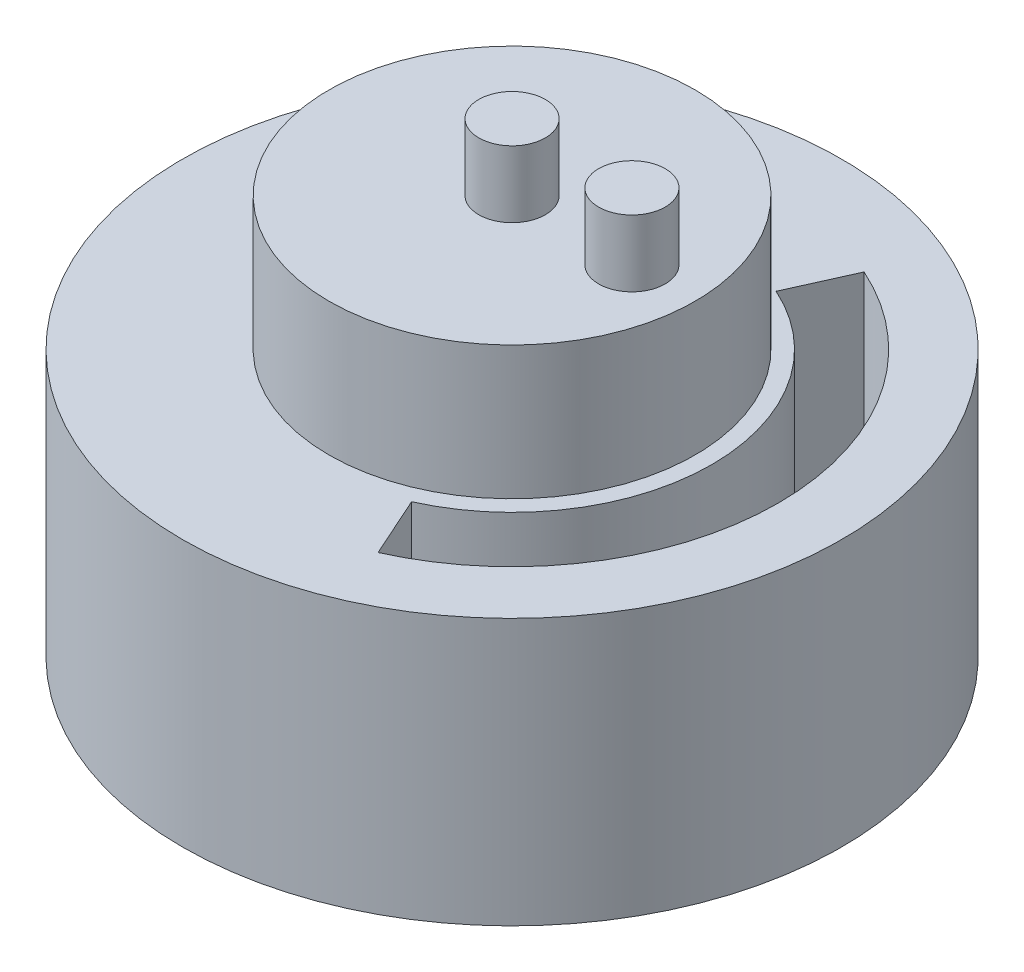
ISO-10303-21;
HEADER;
FILE_DESCRIPTION(('STEP AP214'),'2;1');
FILE_NAME('part.step','',(''),(''),'','','');
FILE_SCHEMA(('AUTOMOTIVE_DESIGN { 1 0 10303 214 1 1 1 1 }'));
ENDSEC;
DATA;
#1=APPLICATION_CONTEXT('core data for automotive mechanical design processes');
#2=APPLICATION_PROTOCOL_DEFINITION('international standard','automotive_design',2000,#1);
#3=PRODUCT_CONTEXT('',#1,'mechanical');
#4=PRODUCT('Part','Part','',(#3));
#5=PRODUCT_RELATED_PRODUCT_CATEGORY('part','',(#4));
#6=PRODUCT_DEFINITION_FORMATION('','',#4);
#7=PRODUCT_DEFINITION_CONTEXT('part definition',#1,'design');
#8=PRODUCT_DEFINITION('design','',#6,#7);
#9=PRODUCT_DEFINITION_SHAPE('','',#8);
#10=(LENGTH_UNIT() NAMED_UNIT(*) SI_UNIT(.MILLI.,.METRE.));
#11=(NAMED_UNIT(*) PLANE_ANGLE_UNIT() SI_UNIT($,.RADIAN.));
#12=(NAMED_UNIT(*) SI_UNIT($,.STERADIAN.) SOLID_ANGLE_UNIT());
#13=UNCERTAINTY_MEASURE_WITH_UNIT(LENGTH_MEASURE(1.E-05),#10,'distance_accuracy_value','');
#14=(GEOMETRIC_REPRESENTATION_CONTEXT(3) GLOBAL_UNCERTAINTY_ASSIGNED_CONTEXT((#13)) GLOBAL_UNIT_ASSIGNED_CONTEXT((#10,
#11,#12)) REPRESENTATION_CONTEXT('',''));
#15=CARTESIAN_POINT('',(0.,0.,0.));
#16=DIRECTION('',(0.,0.,1.));
#17=DIRECTION('',(1.,0.,0.));
#18=AXIS2_PLACEMENT_3D('',#15,#16,#17);
#19=CARTESIAN_POINT('',(0.,20.,0.));
#20=DIRECTION('',(0.,-1.,0.));
#21=DIRECTION('',(0.,0.,-1.));
#22=AXIS2_PLACEMENT_3D('',#19,#20,#21);
#23=CYLINDRICAL_SURFACE('',#22,24.75);
#24=CARTESIAN_POINT('',(0.,20.,0.));
#25=DIRECTION('',(0.,1.,0.));
#26=DIRECTION('',(0.,0.,1.));
#27=AXIS2_PLACEMENT_3D('',#24,#25,#26);
#28=CIRCLE('',#27,24.75);
#29=CARTESIAN_POINT('',(0.,20.,24.75));
#30=VERTEX_POINT('',#29);
#31=EDGE_CURVE('E141',#30,#30,#28,.T.);
#32=ORIENTED_EDGE('',*,*,#31,.F.);
#33=EDGE_LOOP('',(#32));
#34=FACE_BOUND('',#33,.T.);
#35=CARTESIAN_POINT('',(0.,0.,0.));
#36=DIRECTION('',(0.,1.,0.));
#37=DIRECTION('',(0.,0.,1.));
#38=AXIS2_PLACEMENT_3D('',#35,#36,#37);
#39=CIRCLE('',#38,24.75);
#40=CARTESIAN_POINT('',(0.,0.,24.75));
#41=VERTEX_POINT('',#40);
#42=EDGE_CURVE('E44',#41,#41,#39,.T.);
#43=ORIENTED_EDGE('',*,*,#42,.T.);
#44=EDGE_LOOP('',(#43));
#45=FACE_BOUND('',#44,.T.);
#46=ADVANCED_FACE('F41',(#34,#45),#23,.T.);
#47=CARTESIAN_POINT('',(0.,20.,0.));
#48=DIRECTION('',(0.,1.,0.));
#49=DIRECTION('',(0.,0.,1.));
#50=AXIS2_PLACEMENT_3D('',#47,#48,#49);
#51=PLANE('',#50);
#52=CARTESIAN_POINT('',(0.,20.,0.));
#53=DIRECTION('',(0.,-1.,0.));
#54=DIRECTION('',(0.,0.,1.));
#55=AXIS2_PLACEMENT_3D('',#52,#53,#54);
#56=CIRCLE('',#55,15.);
#57=CARTESIAN_POINT('',(6.13929231044262,20.,-13.6860911120356));
#58=VERTEX_POINT('',#57);
#59=CARTESIAN_POINT('',(6.13929231044262,20.,13.6860911120356));
#60=VERTEX_POINT('',#59);
#61=EDGE_CURVE('E58',#58,#60,#56,.T.);
#62=ORIENTED_EDGE('',*,*,#61,.F.);
#63=DIRECTION('',(-0.409286154029508,0.,0.912406074135707));
#64=VECTOR('',#63,1.);
#65=CARTESIAN_POINT('',(8.18572308059016,20.,-18.2481214827141));
#66=LINE('',#65,#64);
#67=CARTESIAN_POINT('',(8.18572308059016,20.,-18.2481214827141));
#68=VERTEX_POINT('',#67);
#69=EDGE_CURVE('E105',#68,#58,#66,.T.);
#70=ORIENTED_EDGE('',*,*,#69,.F.);
#71=CARTESIAN_POINT('',(0.,20.,0.));
#72=DIRECTION('',(0.,1.,0.));
#73=DIRECTION('',(0.,0.,1.));
#74=AXIS2_PLACEMENT_3D('',#71,#72,#73);
#75=CIRCLE('',#74,20.);
#76=CARTESIAN_POINT('',(8.18572308059016,20.,18.2481214827141));
#77=VERTEX_POINT('',#76);
#78=EDGE_CURVE('E87',#77,#68,#75,.T.);
#79=ORIENTED_EDGE('',*,*,#78,.F.);
#80=DIRECTION('',(0.409286154029508,0.,0.912406074135707));
#81=VECTOR('',#80,1.);
#82=CARTESIAN_POINT('',(8.18572308059016,20.,18.2481214827141));
#83=LINE('',#82,#81);
#84=EDGE_CURVE('E97',#60,#77,#83,.T.);
#85=ORIENTED_EDGE('',*,*,#84,.F.);
#86=EDGE_LOOP('',(#62,#70,#79,#85));
#87=FACE_BOUND('',#86,.T.);
#88=CARTESIAN_POINT('',(0.,20.,0.));
#89=DIRECTION('',(0.,1.,0.));
#90=DIRECTION('',(0.,0.,1.));
#91=AXIS2_PLACEMENT_3D('',#88,#89,#90);
#92=CIRCLE('',#91,13.75);
#93=CARTESIAN_POINT('',(0.,20.,13.75));
#94=VERTEX_POINT('',#93);
#95=EDGE_CURVE('E50',#94,#94,#92,.T.);
#96=ORIENTED_EDGE('',*,*,#95,.F.);
#97=EDGE_LOOP('',(#96));
#98=FACE_BOUND('',#97,.T.);
#99=ORIENTED_EDGE('',*,*,#31,.T.);
#100=EDGE_LOOP('',(#99));
#101=FACE_BOUND('',#100,.T.);
#102=ADVANCED_FACE('F102',(#87,#98,#101),#51,.T.);
#103=CARTESIAN_POINT('',(0.,0.,0.));
#104=DIRECTION('',(0.,1.,0.));
#105=DIRECTION('',(0.,0.,1.));
#106=AXIS2_PLACEMENT_3D('',#103,#104,#105);
#107=PLANE('',#106);
#108=DIRECTION('',(0.409286154029508,0.,-0.912406074135707));
#109=VECTOR('',#108,1.);
#110=CARTESIAN_POINT('',(8.18572308059016,0.,-18.2481214827141));
#111=LINE('',#110,#109);
#112=CARTESIAN_POINT('',(6.13929231044262,0.,-13.6860911120356));
#113=VERTEX_POINT('',#112);
#114=CARTESIAN_POINT('',(8.18572308059016,0.,-18.2481214827141));
#115=VERTEX_POINT('',#114);
#116=EDGE_CURVE('E282',#113,#115,#111,.T.);
#117=ORIENTED_EDGE('',*,*,#116,.F.);
#118=CARTESIAN_POINT('',(0.,0.,0.));
#119=DIRECTION('',(0.,1.,0.));
#120=DIRECTION('',(0.,0.,1.));
#121=AXIS2_PLACEMENT_3D('',#118,#119,#120);
#122=CIRCLE('',#121,15.);
#123=CARTESIAN_POINT('',(6.13929231044262,0.,13.6860911120356));
#124=VERTEX_POINT('',#123);
#125=EDGE_CURVE('E123',#124,#113,#122,.T.);
#126=ORIENTED_EDGE('',*,*,#125,.F.);
#127=DIRECTION('',(-0.409286154029508,0.,-0.912406074135707));
#128=VECTOR('',#127,1.);
#129=CARTESIAN_POINT('',(8.18572308059016,0.,18.2481214827141));
#130=LINE('',#129,#128);
#131=CARTESIAN_POINT('',(8.18572308059017,0.,18.2481214827142));
#132=VERTEX_POINT('',#131);
#133=EDGE_CURVE('E119',#132,#124,#130,.T.);
#134=ORIENTED_EDGE('',*,*,#133,.F.);
#135=CARTESIAN_POINT('',(0.,0.,0.));
#136=DIRECTION('',(0.,1.,0.));
#137=DIRECTION('',(0.,0.,1.));
#138=AXIS2_PLACEMENT_3D('',#135,#136,#137);
#139=CIRCLE('',#138,20.);
#140=EDGE_CURVE('E90',#115,#132,#139,.F.);
#141=ORIENTED_EDGE('',*,*,#140,.F.);
#142=EDGE_LOOP('',(#117,#126,#134,#141));
#143=FACE_BOUND('',#142,.T.);
#144=ORIENTED_EDGE('',*,*,#42,.F.);
#145=EDGE_LOOP('',(#144));
#146=FACE_BOUND('',#145,.T.);
#147=ADVANCED_FACE('F151',(#143,#146),#107,.F.);
#148=CARTESIAN_POINT('',(0.,30.,0.));
#149=DIRECTION('',(0.,-1.,0.));
#150=DIRECTION('',(0.,0.,-1.));
#151=AXIS2_PLACEMENT_3D('',#148,#149,#150);
#152=CYLINDRICAL_SURFACE('',#151,13.75);
#153=CARTESIAN_POINT('',(0.,30.,0.));
#154=DIRECTION('',(0.,1.,0.));
#155=DIRECTION('',(0.,0.,1.));
#156=AXIS2_PLACEMENT_3D('',#153,#154,#155);
#157=CIRCLE('',#156,13.75);
#158=CARTESIAN_POINT('',(0.,30.,13.75));
#159=VERTEX_POINT('',#158);
#160=EDGE_CURVE('E134',#159,#159,#157,.T.);
#161=ORIENTED_EDGE('',*,*,#160,.F.);
#162=EDGE_LOOP('',(#161));
#163=FACE_BOUND('',#162,.T.);
#164=ORIENTED_EDGE('',*,*,#95,.T.);
#165=EDGE_LOOP('',(#164));
#166=FACE_BOUND('',#165,.T.);
#167=ADVANCED_FACE('F153',(#163,#166),#152,.T.);
#168=CARTESIAN_POINT('',(0.,30.,0.));
#169=DIRECTION('',(0.,1.,0.));
#170=DIRECTION('',(0.,0.,1.));
#171=AXIS2_PLACEMENT_3D('',#168,#169,#170);
#172=PLANE('',#171);
#173=CARTESIAN_POINT('',(9.,30.,0.));
#174=DIRECTION('',(0.,1.,0.));
#175=DIRECTION('',(0.,0.,1.));
#176=AXIS2_PLACEMENT_3D('',#173,#174,#175);
#177=CIRCLE('',#176,2.5);
#178=CARTESIAN_POINT('',(9.,30.,2.5));
#179=VERTEX_POINT('',#178);
#180=EDGE_CURVE('E122',#179,#179,#177,.T.);
#181=ORIENTED_EDGE('',*,*,#180,.F.);
#182=EDGE_LOOP('',(#181));
#183=FACE_BOUND('',#182,.T.);
#184=CARTESIAN_POINT('',(0.,30.,0.));
#185=DIRECTION('',(0.,1.,0.));
#186=DIRECTION('',(0.,0.,1.));
#187=AXIS2_PLACEMENT_3D('',#184,#185,#186);
#188=CIRCLE('',#187,2.5);
#189=CARTESIAN_POINT('',(0.,30.,2.5));
#190=VERTEX_POINT('',#189);
#191=EDGE_CURVE('E11',#190,#190,#188,.T.);
#192=ORIENTED_EDGE('',*,*,#191,.F.);
#193=EDGE_LOOP('',(#192));
#194=FACE_BOUND('',#193,.T.);
#195=ORIENTED_EDGE('',*,*,#160,.T.);
#196=EDGE_LOOP('',(#195));
#197=FACE_BOUND('',#196,.T.);
#198=ADVANCED_FACE('F159',(#183,#194,#197),#172,.T.);
#199=CARTESIAN_POINT('',(0.,35.,0.));
#200=DIRECTION('',(0.,-1.,0.));
#201=DIRECTION('',(0.,0.,-1.));
#202=AXIS2_PLACEMENT_3D('',#199,#200,#201);
#203=CYLINDRICAL_SURFACE('',#202,2.5);
#204=CARTESIAN_POINT('',(0.,35.,0.));
#205=DIRECTION('',(0.,1.,0.));
#206=DIRECTION('',(0.,0.,1.));
#207=AXIS2_PLACEMENT_3D('',#204,#205,#206);
#208=CIRCLE('',#207,2.5);
#209=CARTESIAN_POINT('',(0.,35.,2.5));
#210=VERTEX_POINT('',#209);
#211=EDGE_CURVE('E128',#210,#210,#208,.T.);
#212=ORIENTED_EDGE('',*,*,#211,.F.);
#213=EDGE_LOOP('',(#212));
#214=FACE_BOUND('',#213,.T.);
#215=ORIENTED_EDGE('',*,*,#191,.T.);
#216=EDGE_LOOP('',(#215));
#217=FACE_BOUND('',#216,.T.);
#218=ADVANCED_FACE('F233',(#214,#217),#203,.T.);
#219=CARTESIAN_POINT('',(0.,35.,0.));
#220=DIRECTION('',(0.,1.,0.));
#221=DIRECTION('',(0.,0.,1.));
#222=AXIS2_PLACEMENT_3D('',#219,#220,#221);
#223=PLANE('',#222);
#224=ORIENTED_EDGE('',*,*,#211,.T.);
#225=EDGE_LOOP('',(#224));
#226=FACE_BOUND('',#225,.T.);
#227=ADVANCED_FACE('F229',(#226),#223,.T.);
#228=CARTESIAN_POINT('',(9.,35.,0.));
#229=DIRECTION('',(0.,-1.,0.));
#230=DIRECTION('',(0.,0.,-1.));
#231=AXIS2_PLACEMENT_3D('',#228,#229,#230);
#232=CYLINDRICAL_SURFACE('',#231,2.5);
#233=CARTESIAN_POINT('',(9.,35.,0.));
#234=DIRECTION('',(0.,1.,0.));
#235=DIRECTION('',(0.,0.,1.));
#236=AXIS2_PLACEMENT_3D('',#233,#234,#235);
#237=CIRCLE('',#236,2.5);
#238=CARTESIAN_POINT('',(9.,35.,2.5));
#239=VERTEX_POINT('',#238);
#240=EDGE_CURVE('E124',#239,#239,#237,.T.);
#241=ORIENTED_EDGE('',*,*,#240,.F.);
#242=EDGE_LOOP('',(#241));
#243=FACE_BOUND('',#242,.T.);
#244=ORIENTED_EDGE('',*,*,#180,.T.);
#245=EDGE_LOOP('',(#244));
#246=FACE_BOUND('',#245,.T.);
#247=ADVANCED_FACE('F225',(#243,#246),#232,.T.);
#248=CARTESIAN_POINT('',(9.,35.,0.));
#249=DIRECTION('',(0.,1.,0.));
#250=DIRECTION('',(0.,0.,1.));
#251=AXIS2_PLACEMENT_3D('',#248,#249,#250);
#252=PLANE('',#251);
#253=ORIENTED_EDGE('',*,*,#240,.T.);
#254=EDGE_LOOP('',(#253));
#255=FACE_BOUND('',#254,.T.);
#256=ADVANCED_FACE('F179',(#255),#252,.T.);
#257=CARTESIAN_POINT('',(0.,-39.0396589156069,0.));
#258=DIRECTION('',(0.,1.,0.));
#259=DIRECTION('',(0.,0.,1.));
#260=AXIS2_PLACEMENT_3D('',#257,#258,#259);
#261=CYLINDRICAL_SURFACE('',#260,15.);
#262=ORIENTED_EDGE('',*,*,#125,.T.);
#263=DIRECTION('',(0.,1.,0.));
#264=VECTOR('',#263,1.);
#265=CARTESIAN_POINT('',(6.13929231044262,-39.0396589156069,-13.6860911120356));
#266=LINE('',#265,#264);
#267=EDGE_CURVE('E112',#113,#58,#266,.T.);
#268=ORIENTED_EDGE('',*,*,#267,.T.);
#269=ORIENTED_EDGE('',*,*,#61,.T.);
#270=DIRECTION('',(0.,1.,0.));
#271=VECTOR('',#270,1.);
#272=CARTESIAN_POINT('',(6.13929231044262,-39.0396589156069,13.6860911120356));
#273=LINE('',#272,#271);
#274=EDGE_CURVE('E94',#124,#60,#273,.T.);
#275=ORIENTED_EDGE('',*,*,#274,.F.);
#276=EDGE_LOOP('',(#262,#268,#269,#275));
#277=FACE_BOUND('',#276,.T.);
#278=ADVANCED_FACE('F189',(#277),#261,.T.);
#279=CARTESIAN_POINT('',(8.18572308059016,-39.0396589156069,-18.2481214827141));
#280=DIRECTION('',(-0.912406074135707,0.,-0.409286154029508));
#281=DIRECTION('',(-0.409286154029508,0.,0.912406074135707));
#282=AXIS2_PLACEMENT_3D('',#279,#280,#281);
#283=PLANE('',#282);
#284=ORIENTED_EDGE('',*,*,#116,.T.);
#285=DIRECTION('',(0.,1.,0.));
#286=VECTOR('',#285,1.);
#287=CARTESIAN_POINT('',(8.18572308059016,-39.0396589156069,-18.2481214827141));
#288=LINE('',#287,#286);
#289=EDGE_CURVE('E93',#115,#68,#288,.T.);
#290=ORIENTED_EDGE('',*,*,#289,.T.);
#291=ORIENTED_EDGE('',*,*,#69,.T.);
#292=ORIENTED_EDGE('',*,*,#267,.F.);
#293=EDGE_LOOP('',(#284,#290,#291,#292));
#294=FACE_BOUND('',#293,.T.);
#295=ADVANCED_FACE('F194',(#294),#283,.F.);
#296=CARTESIAN_POINT('',(0.,-39.0396589156069,0.));
#297=DIRECTION('',(0.,1.,0.));
#298=DIRECTION('',(0.,0.,1.));
#299=AXIS2_PLACEMENT_3D('',#296,#297,#298);
#300=CYLINDRICAL_SURFACE('',#299,20.);
#301=ORIENTED_EDGE('',*,*,#140,.T.);
#302=DIRECTION('',(0.,1.,0.));
#303=VECTOR('',#302,1.);
#304=CARTESIAN_POINT('',(8.18572308059016,-39.0396589156069,18.2481214827141));
#305=LINE('',#304,#303);
#306=EDGE_CURVE('E66',#132,#77,#305,.T.);
#307=ORIENTED_EDGE('',*,*,#306,.T.);
#308=ORIENTED_EDGE('',*,*,#78,.T.);
#309=ORIENTED_EDGE('',*,*,#289,.F.);
#310=EDGE_LOOP('',(#301,#307,#308,#309));
#311=FACE_BOUND('',#310,.T.);
#312=ADVANCED_FACE('F84',(#311),#300,.F.);
#313=CARTESIAN_POINT('',(8.18572308059016,-39.0396589156069,18.2481214827141));
#314=DIRECTION('',(-0.912406074135707,0.,0.409286154029508));
#315=DIRECTION('',(0.409286154029508,0.,0.912406074135707));
#316=AXIS2_PLACEMENT_3D('',#313,#314,#315);
#317=PLANE('',#316);
#318=ORIENTED_EDGE('',*,*,#133,.T.);
#319=ORIENTED_EDGE('',*,*,#274,.T.);
#320=ORIENTED_EDGE('',*,*,#84,.T.);
#321=ORIENTED_EDGE('',*,*,#306,.F.);
#322=EDGE_LOOP('',(#318,#319,#320,#321));
#323=FACE_BOUND('',#322,.T.);
#324=ADVANCED_FACE('F98',(#323),#317,.F.);
#325=CLOSED_SHELL('',(#46,#102,#147,#167,#198,#218,#227,#247,#256,#278,#295,#312,#324));
#326=MANIFOLD_SOLID_BREP('B2',#325);
#327=ADVANCED_BREP_SHAPE_REPRESENTATION('',(#18,#326),#14);
#328=SHAPE_DEFINITION_REPRESENTATION(#9,#327);
ENDSEC;
END-ISO-10303-21;
